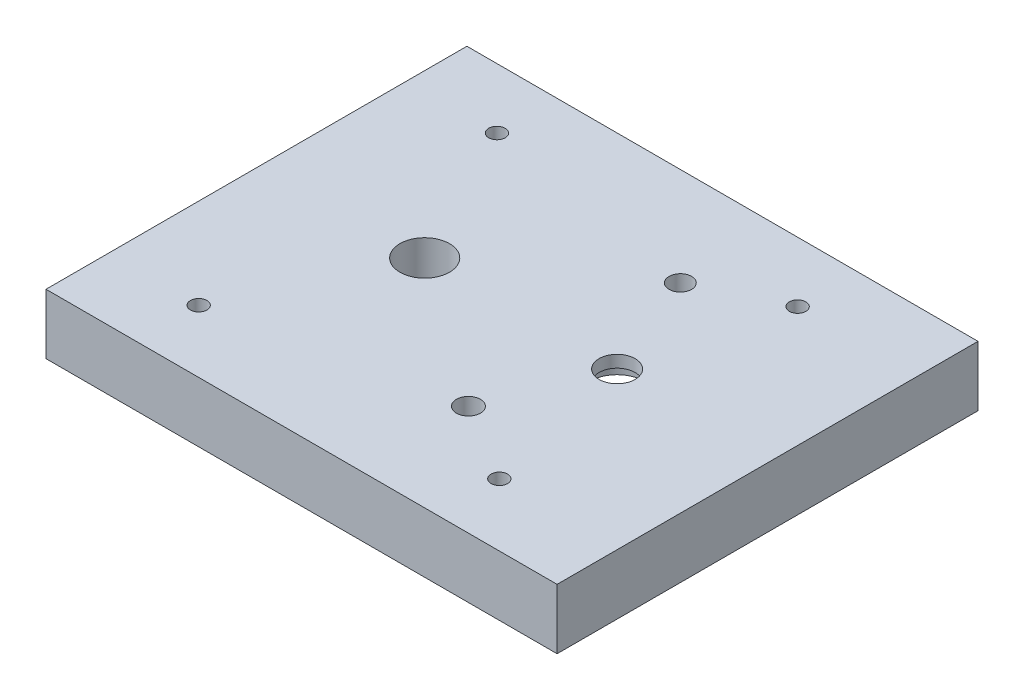
ISO-10303-21;
HEADER;
FILE_DESCRIPTION(('STEP AP214'),'2;1');
FILE_NAME('part.step','',(''),(''),'','','');
FILE_SCHEMA(('AUTOMOTIVE_DESIGN { 1 0 10303 214 1 1 1 1 }'));
ENDSEC;
DATA;
#1=APPLICATION_CONTEXT('core data for automotive mechanical design processes');
#2=APPLICATION_PROTOCOL_DEFINITION('international standard','automotive_design',2000,#1);
#3=PRODUCT_CONTEXT('',#1,'mechanical');
#4=PRODUCT('Part','Part','',(#3));
#5=PRODUCT_RELATED_PRODUCT_CATEGORY('part','',(#4));
#6=PRODUCT_DEFINITION_FORMATION('','',#4);
#7=PRODUCT_DEFINITION_CONTEXT('part definition',#1,'design');
#8=PRODUCT_DEFINITION('design','',#6,#7);
#9=PRODUCT_DEFINITION_SHAPE('','',#8);
#10=(LENGTH_UNIT() NAMED_UNIT(*) SI_UNIT(.MILLI.,.METRE.));
#11=(NAMED_UNIT(*) PLANE_ANGLE_UNIT() SI_UNIT($,.RADIAN.));
#12=(NAMED_UNIT(*) SI_UNIT($,.STERADIAN.) SOLID_ANGLE_UNIT());
#13=UNCERTAINTY_MEASURE_WITH_UNIT(LENGTH_MEASURE(1.E-05),#10,'distance_accuracy_value','');
#14=(GEOMETRIC_REPRESENTATION_CONTEXT(3) GLOBAL_UNCERTAINTY_ASSIGNED_CONTEXT((#13)) GLOBAL_UNIT_ASSIGNED_CONTEXT((#10,
#11,#12)) REPRESENTATION_CONTEXT('',''));
#15=CARTESIAN_POINT('',(0.,0.,0.));
#16=DIRECTION('',(0.,0.,1.));
#17=DIRECTION('',(1.,0.,0.));
#18=AXIS2_PLACEMENT_3D('',#15,#16,#17);
#19=CARTESIAN_POINT('',(42.5,10.,0.));
#20=DIRECTION('',(1.,0.,0.));
#21=DIRECTION('',(0.,0.,-1.));
#22=AXIS2_PLACEMENT_3D('',#19,#20,#21);
#23=PLANE('',#22);
#24=DIRECTION('',(0.,0.,1.));
#25=VECTOR('',#24,1.);
#26=CARTESIAN_POINT('',(42.5,0.,0.));
#27=LINE('',#26,#25);
#28=CARTESIAN_POINT('',(42.5,0.,-35.));
#29=VERTEX_POINT('',#28);
#30=CARTESIAN_POINT('',(42.5,0.,35.));
#31=VERTEX_POINT('',#30);
#32=EDGE_CURVE('E231',#29,#31,#27,.T.);
#33=ORIENTED_EDGE('',*,*,#32,.F.);
#34=DIRECTION('',(0.,-1.,0.));
#35=VECTOR('',#34,1.);
#36=CARTESIAN_POINT('',(42.5,10.,-35.));
#37=LINE('',#36,#35);
#38=CARTESIAN_POINT('',(42.5,10.,-35.));
#39=VERTEX_POINT('',#38);
#40=EDGE_CURVE('E11',#39,#29,#37,.T.);
#41=ORIENTED_EDGE('',*,*,#40,.F.);
#42=DIRECTION('',(0.,0.,1.));
#43=VECTOR('',#42,1.);
#44=CARTESIAN_POINT('',(42.5,10.,0.));
#45=LINE('',#44,#43);
#46=CARTESIAN_POINT('',(42.5,10.,35.));
#47=VERTEX_POINT('',#46);
#48=EDGE_CURVE('E270',#39,#47,#45,.T.);
#49=ORIENTED_EDGE('',*,*,#48,.T.);
#50=DIRECTION('',(0.,-1.,0.));
#51=VECTOR('',#50,1.);
#52=CARTESIAN_POINT('',(42.5,10.,35.));
#53=LINE('',#52,#51);
#54=EDGE_CURVE('E90',#47,#31,#53,.T.);
#55=ORIENTED_EDGE('',*,*,#54,.T.);
#56=EDGE_LOOP('',(#33,#41,#49,#55));
#57=FACE_BOUND('',#56,.T.);
#58=ADVANCED_FACE('F38',(#57),#23,.T.);
#59=CARTESIAN_POINT('',(0.,10.,-35.));
#60=DIRECTION('',(0.,0.,-1.));
#61=DIRECTION('',(-1.,0.,0.));
#62=AXIS2_PLACEMENT_3D('',#59,#60,#61);
#63=PLANE('',#62);
#64=DIRECTION('',(1.,0.,0.));
#65=VECTOR('',#64,1.);
#66=CARTESIAN_POINT('',(0.,0.,-35.));
#67=LINE('',#66,#65);
#68=CARTESIAN_POINT('',(-42.5,0.,-35.));
#69=VERTEX_POINT('',#68);
#70=EDGE_CURVE('E228',#69,#29,#67,.T.);
#71=ORIENTED_EDGE('',*,*,#70,.F.);
#72=DIRECTION('',(0.,-1.,0.));
#73=VECTOR('',#72,1.);
#74=CARTESIAN_POINT('',(-42.5,10.,-35.));
#75=LINE('',#74,#73);
#76=CARTESIAN_POINT('',(-42.5,10.,-35.));
#77=VERTEX_POINT('',#76);
#78=EDGE_CURVE('E47',#77,#69,#75,.T.);
#79=ORIENTED_EDGE('',*,*,#78,.F.);
#80=DIRECTION('',(1.,0.,0.));
#81=VECTOR('',#80,1.);
#82=CARTESIAN_POINT('',(0.,10.,-35.));
#83=LINE('',#82,#81);
#84=EDGE_CURVE('E267',#77,#39,#83,.T.);
#85=ORIENTED_EDGE('',*,*,#84,.T.);
#86=ORIENTED_EDGE('',*,*,#40,.T.);
#87=EDGE_LOOP('',(#71,#79,#85,#86));
#88=FACE_BOUND('',#87,.T.);
#89=ADVANCED_FACE('F453',(#88),#63,.T.);
#90=CARTESIAN_POINT('',(-42.5,10.,0.));
#91=DIRECTION('',(1.,0.,0.));
#92=DIRECTION('',(0.,0.,-1.));
#93=AXIS2_PLACEMENT_3D('',#90,#91,#92);
#94=PLANE('',#93);
#95=DIRECTION('',(0.,0.,1.));
#96=VECTOR('',#95,1.);
#97=CARTESIAN_POINT('',(-42.5,0.,0.));
#98=LINE('',#97,#96);
#99=CARTESIAN_POINT('',(-42.5,0.,35.));
#100=VERTEX_POINT('',#99);
#101=EDGE_CURVE('E225',#69,#100,#98,.T.);
#102=ORIENTED_EDGE('',*,*,#101,.T.);
#103=DIRECTION('',(0.,-1.,0.));
#104=VECTOR('',#103,1.);
#105=CARTESIAN_POINT('',(-42.5,10.,35.));
#106=LINE('',#105,#104);
#107=CARTESIAN_POINT('',(-42.5,10.,35.));
#108=VERTEX_POINT('',#107);
#109=EDGE_CURVE('E208',#108,#100,#106,.T.);
#110=ORIENTED_EDGE('',*,*,#109,.F.);
#111=DIRECTION('',(0.,0.,1.));
#112=VECTOR('',#111,1.);
#113=CARTESIAN_POINT('',(-42.5,10.,0.));
#114=LINE('',#113,#112);
#115=EDGE_CURVE('E265',#77,#108,#114,.T.);
#116=ORIENTED_EDGE('',*,*,#115,.F.);
#117=ORIENTED_EDGE('',*,*,#78,.T.);
#118=EDGE_LOOP('',(#102,#110,#116,#117));
#119=FACE_BOUND('',#118,.T.);
#120=ADVANCED_FACE('F458',(#119),#94,.F.);
#121=CARTESIAN_POINT('',(0.,10.,2.15490997050941));
#122=DIRECTION('',(0.,0.,-1.));
#123=DIRECTION('',(-1.,0.,0.));
#124=AXIS2_PLACEMENT_3D('',#121,#122,#123);
#125=PLANE('',#124);
#126=DIRECTION('',(1.,0.,0.));
#127=VECTOR('',#126,1.);
#128=CARTESIAN_POINT('',(-9.73184743646242,6.,2.15490997050941));
#129=LINE('',#128,#127);
#130=CARTESIAN_POINT('',(-9.73184743646242,6.,2.15490997050941));
#131=VERTEX_POINT('',#130);
#132=CARTESIAN_POINT('',(-7.49999999999999,6.,2.15490997050941));
#133=VERTEX_POINT('',#132);
#134=EDGE_CURVE('E182',#131,#133,#129,.T.);
#135=ORIENTED_EDGE('',*,*,#134,.T.);
#136=DIRECTION('',(0.,-1.,0.));
#137=VECTOR('',#136,1.);
#138=CARTESIAN_POINT('',(-7.49999999999999,6.,2.15490997050941));
#139=LINE('',#138,#137);
#140=CARTESIAN_POINT('',(-7.49999999999999,0.,2.15490997050941));
#141=VERTEX_POINT('',#140);
#142=EDGE_CURVE('E285',#133,#141,#139,.T.);
#143=ORIENTED_EDGE('',*,*,#142,.T.);
#144=DIRECTION('',(1.,0.,0.));
#145=VECTOR('',#144,1.);
#146=CARTESIAN_POINT('',(0.,0.,2.15490997050941));
#147=LINE('',#146,#145);
#148=CARTESIAN_POINT('',(-9.73184743646242,0.,2.15490997050941));
#149=VERTEX_POINT('',#148);
#150=EDGE_CURVE('E207',#149,#141,#147,.T.);
#151=ORIENTED_EDGE('',*,*,#150,.F.);
#152=DIRECTION('',(0.,-1.,0.));
#153=VECTOR('',#152,1.);
#154=CARTESIAN_POINT('',(-9.73184743646242,10.,2.15490997050941));
#155=LINE('',#154,#153);
#156=EDGE_CURVE('E201',#131,#149,#155,.T.);
#157=ORIENTED_EDGE('',*,*,#156,.F.);
#158=EDGE_LOOP('',(#135,#143,#151,#157));
#159=FACE_BOUND('',#158,.T.);
#160=ADVANCED_FACE('F40',(#159),#125,.T.);
#161=CARTESIAN_POINT('',(-9.73184743646242,10.,0.));
#162=DIRECTION('',(-1.,0.,0.));
#163=DIRECTION('',(0.,0.,1.));
#164=AXIS2_PLACEMENT_3D('',#161,#162,#163);
#165=PLANE('',#164);
#166=DIRECTION('',(0.,-1.,0.));
#167=VECTOR('',#166,1.);
#168=CARTESIAN_POINT('',(-9.73184743646242,10.,-4.15490997050938));
#169=LINE('',#168,#167);
#170=CARTESIAN_POINT('',(-9.73184743646242,6.,-4.15490997050938));
#171=VERTEX_POINT('',#170);
#172=CARTESIAN_POINT('',(-9.73184743646242,0.,-4.15490997050938));
#173=VERTEX_POINT('',#172);
#174=EDGE_CURVE('E203',#171,#173,#169,.T.);
#175=ORIENTED_EDGE('',*,*,#174,.F.);
#176=DIRECTION('',(0.,0.,1.));
#177=VECTOR('',#176,1.);
#178=CARTESIAN_POINT('',(-9.73184743646242,6.,2.15490997050941));
#179=LINE('',#178,#177);
#180=EDGE_CURVE('E186',#171,#131,#179,.T.);
#181=ORIENTED_EDGE('',*,*,#180,.T.);
#182=ORIENTED_EDGE('',*,*,#156,.T.);
#183=DIRECTION('',(0.,0.,-1.));
#184=VECTOR('',#183,1.);
#185=CARTESIAN_POINT('',(-9.73184743646242,0.,0.));
#186=LINE('',#185,#184);
#187=EDGE_CURVE('E246',#149,#173,#186,.T.);
#188=ORIENTED_EDGE('',*,*,#187,.T.);
#189=EDGE_LOOP('',(#175,#181,#182,#188));
#190=FACE_BOUND('',#189,.T.);
#191=ADVANCED_FACE('F199',(#190),#165,.F.);
#192=CARTESIAN_POINT('',(-15.52,10.,-0.999999999999982));
#193=DIRECTION('',(0.,-1.,0.));
#194=DIRECTION('',(0.,0.,-1.));
#195=AXIS2_PLACEMENT_3D('',#192,#193,#194);
#196=CYLINDRICAL_SURFACE('',#195,4.125);
#197=CARTESIAN_POINT('',(-15.52,10.,-0.999999999999982));
#198=DIRECTION('',(0.,1.,0.));
#199=DIRECTION('',(0.,0.,1.));
#200=AXIS2_PLACEMENT_3D('',#197,#198,#199);
#201=CIRCLE('',#200,4.125);
#202=CARTESIAN_POINT('',(-15.52,10.,3.12500000000002));
#203=VERTEX_POINT('',#202);
#204=EDGE_CURVE('E252',#203,#203,#201,.T.);
#205=ORIENTED_EDGE('',*,*,#204,.T.);
#206=EDGE_LOOP('',(#205));
#207=FACE_BOUND('',#206,.T.);
#208=CARTESIAN_POINT('',(-15.52,0.,-0.999999999999982));
#209=DIRECTION('',(0.,1.,0.));
#210=DIRECTION('',(0.,0.,1.));
#211=AXIS2_PLACEMENT_3D('',#208,#209,#210);
#212=CIRCLE('',#211,4.125);
#213=CARTESIAN_POINT('',(-15.52,0.,3.12500000000002));
#214=VERTEX_POINT('',#213);
#215=EDGE_CURVE('E216',#214,#214,#212,.T.);
#216=ORIENTED_EDGE('',*,*,#215,.F.);
#217=EDGE_LOOP('',(#216));
#218=FACE_BOUND('',#217,.T.);
#219=ADVANCED_FACE('F479',(#207,#218),#196,.F.);
#220=CARTESIAN_POINT('',(9.47498964468786,10.,16.7226001518999));
#221=DIRECTION('',(0.,-1.,0.));
#222=DIRECTION('',(0.,0.,-1.));
#223=AXIS2_PLACEMENT_3D('',#220,#221,#222);
#224=CYLINDRICAL_SURFACE('',#223,2.);
#225=CARTESIAN_POINT('',(9.47498964468786,6.,16.7226001518999));
#226=DIRECTION('',(0.,1.,0.));
#227=DIRECTION('',(0.,0.,1.));
#228=AXIS2_PLACEMENT_3D('',#225,#226,#227);
#229=CIRCLE('',#228,2.);
#230=CARTESIAN_POINT('',(9.47498964468786,6.,18.7226001518999));
#231=VERTEX_POINT('',#230);
#232=EDGE_CURVE('E371',#231,#231,#229,.T.);
#233=ORIENTED_EDGE('',*,*,#232,.F.);
#234=EDGE_LOOP('',(#233));
#235=FACE_BOUND('',#234,.T.);
#236=CARTESIAN_POINT('',(9.47498964468786,10.,16.7226001518999));
#237=DIRECTION('',(0.,1.,0.));
#238=DIRECTION('',(0.,0.,1.));
#239=AXIS2_PLACEMENT_3D('',#236,#237,#238);
#240=CIRCLE('',#239,2.);
#241=CARTESIAN_POINT('',(9.47498964468786,10.,18.7226001518999));
#242=VERTEX_POINT('',#241);
#243=EDGE_CURVE('E255',#242,#242,#240,.T.);
#244=ORIENTED_EDGE('',*,*,#243,.T.);
#245=EDGE_LOOP('',(#244));
#246=FACE_BOUND('',#245,.T.);
#247=ADVANCED_FACE('F484',(#235,#246),#224,.F.);
#248=CARTESIAN_POINT('',(9.33088549516382,10.,-18.6646873960116));
#249=DIRECTION('',(0.,-1.,0.));
#250=DIRECTION('',(0.,0.,-1.));
#251=AXIS2_PLACEMENT_3D('',#248,#249,#250);
#252=CYLINDRICAL_SURFACE('',#251,1.875);
#253=CARTESIAN_POINT('',(9.33088549516382,6.,-18.6646873960116));
#254=DIRECTION('',(0.,1.,0.));
#255=DIRECTION('',(0.,0.,1.));
#256=AXIS2_PLACEMENT_3D('',#253,#254,#255);
#257=CIRCLE('',#256,1.875);
#258=CARTESIAN_POINT('',(9.33088549516382,6.,-16.7896873960116));
#259=VERTEX_POINT('',#258);
#260=EDGE_CURVE('E311',#259,#259,#257,.T.);
#261=ORIENTED_EDGE('',*,*,#260,.F.);
#262=EDGE_LOOP('',(#261));
#263=FACE_BOUND('',#262,.T.);
#264=CARTESIAN_POINT('',(9.33088549516382,10.,-18.6646873960116));
#265=DIRECTION('',(0.,1.,0.));
#266=DIRECTION('',(0.,0.,1.));
#267=AXIS2_PLACEMENT_3D('',#264,#265,#266);
#268=CIRCLE('',#267,1.875);
#269=CARTESIAN_POINT('',(9.33088549516382,10.,-16.7896873960116));
#270=VERTEX_POINT('',#269);
#271=EDGE_CURVE('E258',#270,#270,#268,.T.);
#272=ORIENTED_EDGE('',*,*,#271,.T.);
#273=EDGE_LOOP('',(#272));
#274=FACE_BOUND('',#273,.T.);
#275=ADVANCED_FACE('F500',(#263,#274),#252,.F.);
#276=CARTESIAN_POINT('',(-27.5,10.,24.6066772895717));
#277=DIRECTION('',(0.,-1.,0.));
#278=DIRECTION('',(0.,0.,-1.));
#279=AXIS2_PLACEMENT_3D('',#276,#277,#278);
#280=CYLINDRICAL_SURFACE('',#279,1.375);
#281=CARTESIAN_POINT('',(-27.5,10.,24.6066772895717));
#282=DIRECTION('',(0.,1.,0.));
#283=DIRECTION('',(0.,0.,1.));
#284=AXIS2_PLACEMENT_3D('',#281,#282,#283);
#285=CIRCLE('',#284,1.375);
#286=CARTESIAN_POINT('',(-27.5,10.,25.9816772895717));
#287=VERTEX_POINT('',#286);
#288=EDGE_CURVE('E261',#287,#287,#285,.F.);
#289=ORIENTED_EDGE('',*,*,#288,.F.);
#290=EDGE_LOOP('',(#289));
#291=FACE_BOUND('',#290,.T.);
#292=CARTESIAN_POINT('',(-27.5,0.,24.6066772895717));
#293=DIRECTION('',(0.,1.,0.));
#294=DIRECTION('',(0.,0.,1.));
#295=AXIS2_PLACEMENT_3D('',#292,#293,#294);
#296=CIRCLE('',#295,1.375);
#297=CARTESIAN_POINT('',(-27.5,0.,25.9816772895717));
#298=VERTEX_POINT('',#297);
#299=EDGE_CURVE('E220',#298,#298,#296,.F.);
#300=ORIENTED_EDGE('',*,*,#299,.T.);
#301=EDGE_LOOP('',(#300));
#302=FACE_BOUND('',#301,.T.);
#303=ADVANCED_FACE('F496',(#291,#302),#280,.F.);
#304=CARTESIAN_POINT('',(0.,10.,35.));
#305=DIRECTION('',(0.,0.,-1.));
#306=DIRECTION('',(-1.,0.,0.));
#307=AXIS2_PLACEMENT_3D('',#304,#305,#306);
#308=PLANE('',#307);
#309=DIRECTION('',(1.,0.,0.));
#310=VECTOR('',#309,1.);
#311=CARTESIAN_POINT('',(0.,0.,35.));
#312=LINE('',#311,#310);
#313=EDGE_CURVE('E223',#100,#31,#312,.T.);
#314=ORIENTED_EDGE('',*,*,#313,.T.);
#315=ORIENTED_EDGE('',*,*,#54,.F.);
#316=DIRECTION('',(1.,0.,0.));
#317=VECTOR('',#316,1.);
#318=CARTESIAN_POINT('',(0.,10.,35.));
#319=LINE('',#318,#317);
#320=EDGE_CURVE('E64',#108,#47,#319,.T.);
#321=ORIENTED_EDGE('',*,*,#320,.F.);
#322=ORIENTED_EDGE('',*,*,#109,.T.);
#323=EDGE_LOOP('',(#314,#315,#321,#322));
#324=FACE_BOUND('',#323,.T.);
#325=ADVANCED_FACE('F467',(#324),#308,.F.);
#326=CARTESIAN_POINT('',(-27.5,10.,-25.));
#327=DIRECTION('',(0.,-1.,0.));
#328=DIRECTION('',(0.,0.,-1.));
#329=AXIS2_PLACEMENT_3D('',#326,#327,#328);
#330=CYLINDRICAL_SURFACE('',#329,1.375);
#331=CARTESIAN_POINT('',(-27.5,10.,-25.));
#332=DIRECTION('',(0.,1.,0.));
#333=DIRECTION('',(0.,0.,1.));
#334=AXIS2_PLACEMENT_3D('',#331,#332,#333);
#335=CIRCLE('',#334,1.375);
#336=CARTESIAN_POINT('',(-27.5,10.,-23.625));
#337=VERTEX_POINT('',#336);
#338=EDGE_CURVE('E272',#337,#337,#335,.T.);
#339=ORIENTED_EDGE('',*,*,#338,.T.);
#340=EDGE_LOOP('',(#339));
#341=FACE_BOUND('',#340,.T.);
#342=CARTESIAN_POINT('',(-27.5,0.,-25.));
#343=DIRECTION('',(0.,1.,0.));
#344=DIRECTION('',(0.,0.,1.));
#345=AXIS2_PLACEMENT_3D('',#342,#343,#344);
#346=CIRCLE('',#345,1.375);
#347=CARTESIAN_POINT('',(-27.5,0.,-23.625));
#348=VERTEX_POINT('',#347);
#349=EDGE_CURVE('E234',#348,#348,#346,.T.);
#350=ORIENTED_EDGE('',*,*,#349,.F.);
#351=EDGE_LOOP('',(#350));
#352=FACE_BOUND('',#351,.T.);
#353=ADVANCED_FACE('F463',(#341,#352),#330,.F.);
#354=CARTESIAN_POINT('',(22.5,10.,-25.));
#355=DIRECTION('',(0.,-1.,0.));
#356=DIRECTION('',(0.,0.,-1.));
#357=AXIS2_PLACEMENT_3D('',#354,#355,#356);
#358=CYLINDRICAL_SURFACE('',#357,1.375);
#359=CARTESIAN_POINT('',(22.5,10.,-25.));
#360=DIRECTION('',(0.,1.,0.));
#361=DIRECTION('',(0.,0.,1.));
#362=AXIS2_PLACEMENT_3D('',#359,#360,#361);
#363=CIRCLE('',#362,1.375);
#364=CARTESIAN_POINT('',(22.5,10.,-23.625));
#365=VERTEX_POINT('',#364);
#366=EDGE_CURVE('E275',#365,#365,#363,.T.);
#367=ORIENTED_EDGE('',*,*,#366,.T.);
#368=EDGE_LOOP('',(#367));
#369=FACE_BOUND('',#368,.T.);
#370=CARTESIAN_POINT('',(22.5,0.,-25.));
#371=DIRECTION('',(0.,1.,0.));
#372=DIRECTION('',(0.,0.,1.));
#373=AXIS2_PLACEMENT_3D('',#370,#371,#372);
#374=CIRCLE('',#373,1.375);
#375=CARTESIAN_POINT('',(22.5,0.,-23.625));
#376=VERTEX_POINT('',#375);
#377=EDGE_CURVE('E237',#376,#376,#374,.T.);
#378=ORIENTED_EDGE('',*,*,#377,.F.);
#379=EDGE_LOOP('',(#378));
#380=FACE_BOUND('',#379,.T.);
#381=ADVANCED_FACE('F466',(#369,#380),#358,.F.);
#382=CARTESIAN_POINT('',(22.5,10.,24.6066772895717));
#383=DIRECTION('',(0.,-1.,0.));
#384=DIRECTION('',(0.,0.,-1.));
#385=AXIS2_PLACEMENT_3D('',#382,#383,#384);
#386=CYLINDRICAL_SURFACE('',#385,1.375);
#387=CARTESIAN_POINT('',(22.5,10.,24.6066772895717));
#388=DIRECTION('',(0.,1.,0.));
#389=DIRECTION('',(0.,0.,1.));
#390=AXIS2_PLACEMENT_3D('',#387,#388,#389);
#391=CIRCLE('',#390,1.375);
#392=CARTESIAN_POINT('',(22.5,10.,25.9816772895717));
#393=VERTEX_POINT('',#392);
#394=EDGE_CURVE('E219',#393,#393,#391,.F.);
#395=ORIENTED_EDGE('',*,*,#394,.F.);
#396=EDGE_LOOP('',(#395));
#397=FACE_BOUND('',#396,.T.);
#398=CARTESIAN_POINT('',(22.5,0.,24.6066772895717));
#399=DIRECTION('',(0.,1.,0.));
#400=DIRECTION('',(0.,0.,1.));
#401=AXIS2_PLACEMENT_3D('',#398,#399,#400);
#402=CIRCLE('',#401,1.375);
#403=CARTESIAN_POINT('',(22.5,0.,25.9816772895717));
#404=VERTEX_POINT('',#403);
#405=EDGE_CURVE('E240',#404,#404,#402,.F.);
#406=ORIENTED_EDGE('',*,*,#405,.T.);
#407=EDGE_LOOP('',(#406));
#408=FACE_BOUND('',#407,.T.);
#409=ADVANCED_FACE('F471',(#397,#408),#386,.F.);
#410=CARTESIAN_POINT('',(0.,10.,-4.15490997050937));
#411=DIRECTION('',(0.,0.,-1.));
#412=DIRECTION('',(-1.,0.,0.));
#413=AXIS2_PLACEMENT_3D('',#410,#411,#412);
#414=PLANE('',#413);
#415=DIRECTION('',(0.,-1.,0.));
#416=VECTOR('',#415,1.);
#417=CARTESIAN_POINT('',(-7.49999999999999,6.,-4.15490997050938));
#418=LINE('',#417,#416);
#419=CARTESIAN_POINT('',(-7.49999999999999,6.,-4.15490997050938));
#420=VERTEX_POINT('',#419);
#421=CARTESIAN_POINT('',(-7.49999999999999,0.,-4.15490997050938));
#422=VERTEX_POINT('',#421);
#423=EDGE_CURVE('E283',#420,#422,#418,.T.);
#424=ORIENTED_EDGE('',*,*,#423,.F.);
#425=DIRECTION('',(-1.,0.,0.));
#426=VECTOR('',#425,1.);
#427=CARTESIAN_POINT('',(-9.73184743646242,6.,-4.15490997050938));
#428=LINE('',#427,#426);
#429=EDGE_CURVE('E195',#420,#171,#428,.T.);
#430=ORIENTED_EDGE('',*,*,#429,.T.);
#431=ORIENTED_EDGE('',*,*,#174,.T.);
#432=DIRECTION('',(1.,0.,0.));
#433=VECTOR('',#432,1.);
#434=CARTESIAN_POINT('',(0.,0.,-4.15490997050937));
#435=LINE('',#434,#433);
#436=EDGE_CURVE('E243',#173,#422,#435,.T.);
#437=ORIENTED_EDGE('',*,*,#436,.T.);
#438=EDGE_LOOP('',(#424,#430,#431,#437));
#439=FACE_BOUND('',#438,.T.);
#440=ADVANCED_FACE('F384',(#439),#414,.F.);
#441=CARTESIAN_POINT('',(16.4783394877401,10.,-0.999882702112446));
#442=DIRECTION('',(0.,-1.,0.));
#443=DIRECTION('',(0.,0.,-1.));
#444=AXIS2_PLACEMENT_3D('',#441,#442,#443);
#445=CYLINDRICAL_SURFACE('',#444,2.99999999999999);
#446=CARTESIAN_POINT('',(16.4783394877401,8.,-0.999882702112446));
#447=DIRECTION('',(0.,1.,0.));
#448=DIRECTION('',(0.,0.,1.));
#449=AXIS2_PLACEMENT_3D('',#446,#447,#448);
#450=CIRCLE('',#449,2.99999999999999);
#451=CARTESIAN_POINT('',(16.4783394877401,8.,2.00011729788755));
#452=VERTEX_POINT('',#451);
#453=EDGE_CURVE('E379',#452,#452,#450,.T.);
#454=ORIENTED_EDGE('',*,*,#453,.F.);
#455=EDGE_LOOP('',(#454));
#456=FACE_BOUND('',#455,.T.);
#457=CARTESIAN_POINT('',(16.4783394877401,10.,-0.999882702112446));
#458=DIRECTION('',(0.,1.,0.));
#459=DIRECTION('',(0.,0.,1.));
#460=AXIS2_PLACEMENT_3D('',#457,#458,#459);
#461=CIRCLE('',#460,2.99999999999999);
#462=CARTESIAN_POINT('',(16.4783394877401,10.,2.00011729788755));
#463=VERTEX_POINT('',#462);
#464=EDGE_CURVE('E210',#463,#463,#461,.T.);
#465=ORIENTED_EDGE('',*,*,#464,.T.);
#466=EDGE_LOOP('',(#465));
#467=FACE_BOUND('',#466,.T.);
#468=ADVANCED_FACE('F477',(#456,#467),#445,.F.);
#469=CARTESIAN_POINT('',(0.,10.,0.));
#470=DIRECTION('',(0.,1.,0.));
#471=DIRECTION('',(0.,0.,1.));
#472=AXIS2_PLACEMENT_3D('',#469,#470,#471);
#473=PLANE('',#472);
#474=ORIENTED_EDGE('',*,*,#394,.T.);
#475=EDGE_LOOP('',(#474));
#476=FACE_BOUND('',#475,.T.);
#477=ORIENTED_EDGE('',*,*,#366,.F.);
#478=EDGE_LOOP('',(#477));
#479=FACE_BOUND('',#478,.T.);
#480=ORIENTED_EDGE('',*,*,#338,.F.);
#481=EDGE_LOOP('',(#480));
#482=FACE_BOUND('',#481,.T.);
#483=ORIENTED_EDGE('',*,*,#48,.F.);
#484=ORIENTED_EDGE('',*,*,#84,.F.);
#485=ORIENTED_EDGE('',*,*,#115,.T.);
#486=ORIENTED_EDGE('',*,*,#320,.T.);
#487=EDGE_LOOP('',(#483,#484,#485,#486));
#488=FACE_BOUND('',#487,.T.);
#489=ORIENTED_EDGE('',*,*,#288,.T.);
#490=EDGE_LOOP('',(#489));
#491=FACE_BOUND('',#490,.T.);
#492=ORIENTED_EDGE('',*,*,#271,.F.);
#493=EDGE_LOOP('',(#492));
#494=FACE_BOUND('',#493,.T.);
#495=ORIENTED_EDGE('',*,*,#243,.F.);
#496=EDGE_LOOP('',(#495));
#497=FACE_BOUND('',#496,.T.);
#498=ORIENTED_EDGE('',*,*,#204,.F.);
#499=EDGE_LOOP('',(#498));
#500=FACE_BOUND('',#499,.T.);
#501=ORIENTED_EDGE('',*,*,#464,.F.);
#502=EDGE_LOOP('',(#501));
#503=FACE_BOUND('',#502,.T.);
#504=ADVANCED_FACE('F510',(#476,#479,#482,#488,#491,#494,#497,#500,#503),#473,.T.);
#505=CARTESIAN_POINT('',(0.,0.,0.));
#506=DIRECTION('',(0.,1.,0.));
#507=DIRECTION('',(0.,0.,1.));
#508=AXIS2_PLACEMENT_3D('',#505,#506,#507);
#509=PLANE('',#508);
#510=DIRECTION('',(1.,0.,0.));
#511=VECTOR('',#510,1.);
#512=CARTESIAN_POINT('',(0.,0.,-7.99999999999999));
#513=LINE('',#512,#511);
#514=CARTESIAN_POINT('',(-7.49999999999999,0.,-7.99999999999999));
#515=VERTEX_POINT('',#514);
#516=CARTESIAN_POINT('',(-2.85475616918439,0.,-7.99999999999999));
#517=VERTEX_POINT('',#516);
#518=EDGE_CURVE('E340',#515,#517,#513,.T.);
#519=ORIENTED_EDGE('',*,*,#518,.F.);
#520=DIRECTION('',(0.,0.,-1.));
#521=VECTOR('',#520,1.);
#522=CARTESIAN_POINT('',(-7.49999999999999,0.,0.));
#523=LINE('',#522,#521);
#524=EDGE_CURVE('E337',#422,#515,#523,.T.);
#525=ORIENTED_EDGE('',*,*,#524,.F.);
#526=ORIENTED_EDGE('',*,*,#436,.F.);
#527=ORIENTED_EDGE('',*,*,#187,.F.);
#528=ORIENTED_EDGE('',*,*,#150,.T.);
#529=CARTESIAN_POINT('',(-7.49999999999999,0.,6.00000000000001));
#530=VERTEX_POINT('',#529);
#531=EDGE_CURVE('E336',#530,#141,#523,.T.);
#532=ORIENTED_EDGE('',*,*,#531,.F.);
#533=DIRECTION('',(1.,0.,0.));
#534=VECTOR('',#533,1.);
#535=CARTESIAN_POINT('',(0.,0.,6.00000000000001));
#536=LINE('',#535,#534);
#537=CARTESIAN_POINT('',(-2.85475616918439,0.,6.00000000000001));
#538=VERTEX_POINT('',#537);
#539=EDGE_CURVE('E333',#530,#538,#536,.T.);
#540=ORIENTED_EDGE('',*,*,#539,.T.);
#541=CARTESIAN_POINT('',(9.50000000000001,0.,-0.999999999999987));
#542=DIRECTION('',(0.,1.,0.));
#543=DIRECTION('',(0.,0.,1.));
#544=AXIS2_PLACEMENT_3D('',#541,#542,#543);
#545=CIRCLE('',#544,14.2);
#546=CARTESIAN_POINT('',(5.84998964468786,0.,12.7228795959928));
#547=VERTEX_POINT('',#546);
#548=EDGE_CURVE('E330',#538,#547,#545,.T.);
#549=ORIENTED_EDGE('',*,*,#548,.T.);
#550=DIRECTION('',(0.,0.,-1.));
#551=VECTOR('',#550,1.);
#552=CARTESIAN_POINT('',(5.84998964468786,0.,0.));
#553=LINE('',#552,#551);
#554=CARTESIAN_POINT('',(5.84998964468786,0.,16.7226001518999));
#555=VERTEX_POINT('',#554);
#556=EDGE_CURVE('E327',#555,#547,#553,.T.);
#557=ORIENTED_EDGE('',*,*,#556,.F.);
#558=CARTESIAN_POINT('',(9.47498964468786,0.,16.7226001518999));
#559=DIRECTION('',(0.,1.,0.));
#560=DIRECTION('',(0.,0.,1.));
#561=AXIS2_PLACEMENT_3D('',#558,#559,#560);
#562=CIRCLE('',#561,3.625);
#563=CARTESIAN_POINT('',(13.0999896446879,0.,16.7226001518999));
#564=VERTEX_POINT('',#563);
#565=EDGE_CURVE('E324',#555,#564,#562,.T.);
#566=ORIENTED_EDGE('',*,*,#565,.T.);
#567=DIRECTION('',(0.,0.,-1.));
#568=VECTOR('',#567,1.);
#569=CARTESIAN_POINT('',(13.0999896446879,0.,0.));
#570=LINE('',#569,#568);
#571=CARTESIAN_POINT('',(13.0999896446879,0.,12.7360865809058));
#572=VERTEX_POINT('',#571);
#573=EDGE_CURVE('E321',#564,#572,#570,.T.);
#574=ORIENTED_EDGE('',*,*,#573,.T.);
#575=CARTESIAN_POINT('',(9.50000000000001,0.,-0.999999999999987));
#576=DIRECTION('',(0.,1.,0.));
#577=DIRECTION('',(0.,0.,1.));
#578=AXIS2_PLACEMENT_3D('',#575,#576,#577);
#579=CIRCLE('',#578,14.2);
#580=CARTESIAN_POINT('',(12.9558854951638,0.,-14.7730481537064));
#581=VERTEX_POINT('',#580);
#582=EDGE_CURVE('E318',#572,#581,#579,.T.);
#583=ORIENTED_EDGE('',*,*,#582,.T.);
#584=DIRECTION('',(0.,0.,1.));
#585=VECTOR('',#584,1.);
#586=CARTESIAN_POINT('',(12.9558854951638,0.,0.));
#587=LINE('',#586,#585);
#588=CARTESIAN_POINT('',(12.9558854951638,0.,-18.6646873960117));
#589=VERTEX_POINT('',#588);
#590=EDGE_CURVE('E315',#589,#581,#587,.T.);
#591=ORIENTED_EDGE('',*,*,#590,.F.);
#592=CARTESIAN_POINT('',(9.33088549516382,0.,-18.6646873960116));
#593=DIRECTION('',(0.,1.,0.));
#594=DIRECTION('',(0.,0.,1.));
#595=AXIS2_PLACEMENT_3D('',#592,#593,#594);
#596=CIRCLE('',#595,3.625);
#597=CARTESIAN_POINT('',(5.70588549516382,0.,-18.6646873960116));
#598=VERTEX_POINT('',#597);
#599=EDGE_CURVE('E312',#589,#598,#596,.T.);
#600=ORIENTED_EDGE('',*,*,#599,.T.);
#601=DIRECTION('',(0.,0.,1.));
#602=VECTOR('',#601,1.);
#603=CARTESIAN_POINT('',(5.70588549516382,0.,0.));
#604=LINE('',#603,#602);
#605=CARTESIAN_POINT('',(5.70588549516382,0.,-14.6837383460877));
#606=VERTEX_POINT('',#605);
#607=EDGE_CURVE('E308',#598,#606,#604,.T.);
#608=ORIENTED_EDGE('',*,*,#607,.T.);
#609=CARTESIAN_POINT('',(9.50000000000001,0.,-0.999999999999987));
#610=DIRECTION('',(0.,1.,0.));
#611=DIRECTION('',(0.,0.,1.));
#612=AXIS2_PLACEMENT_3D('',#609,#610,#611);
#613=CIRCLE('',#612,14.2);
#614=EDGE_CURVE('E55',#606,#517,#613,.T.);
#615=ORIENTED_EDGE('',*,*,#614,.T.);
#616=EDGE_LOOP('',(#519,#525,#526,#527,#528,#532,#540,#549,#557,#566,#574,#583,#591,#600,#608,#615));
#617=FACE_BOUND('',#616,.T.);
#618=ORIENTED_EDGE('',*,*,#405,.F.);
#619=EDGE_LOOP('',(#618));
#620=FACE_BOUND('',#619,.T.);
#621=ORIENTED_EDGE('',*,*,#377,.T.);
#622=EDGE_LOOP('',(#621));
#623=FACE_BOUND('',#622,.T.);
#624=ORIENTED_EDGE('',*,*,#349,.T.);
#625=EDGE_LOOP('',(#624));
#626=FACE_BOUND('',#625,.T.);
#627=ORIENTED_EDGE('',*,*,#32,.T.);
#628=ORIENTED_EDGE('',*,*,#313,.F.);
#629=ORIENTED_EDGE('',*,*,#101,.F.);
#630=ORIENTED_EDGE('',*,*,#70,.T.);
#631=EDGE_LOOP('',(#627,#628,#629,#630));
#632=FACE_BOUND('',#631,.T.);
#633=ORIENTED_EDGE('',*,*,#299,.F.);
#634=EDGE_LOOP('',(#633));
#635=FACE_BOUND('',#634,.T.);
#636=ORIENTED_EDGE('',*,*,#215,.T.);
#637=EDGE_LOOP('',(#636));
#638=FACE_BOUND('',#637,.T.);
#639=ADVANCED_FACE('F403',(#617,#620,#623,#626,#632,#635,#638),#509,.F.);
#640=CARTESIAN_POINT('',(16.4783394877401,6.,-0.999882702112446));
#641=DIRECTION('',(0.,1.,0.));
#642=DIRECTION('',(0.,0.,1.));
#643=AXIS2_PLACEMENT_3D('',#640,#641,#642);
#644=PLANE('',#643);
#645=CARTESIAN_POINT('',(16.4783394877401,6.,-0.999882702112446));
#646=DIRECTION('',(0.,1.,0.));
#647=DIRECTION('',(0.,0.,1.));
#648=AXIS2_PLACEMENT_3D('',#645,#646,#647);
#649=CIRCLE('',#648,4.5);
#650=CARTESIAN_POINT('',(16.4783394877401,6.,3.50011729788756));
#651=VERTEX_POINT('',#650);
#652=EDGE_CURVE('E42',#651,#651,#649,.F.);
#653=ORIENTED_EDGE('',*,*,#652,.F.);
#654=EDGE_LOOP('',(#653));
#655=FACE_BOUND('',#654,.T.);
#656=DIRECTION('',(0.,0.,-1.));
#657=VECTOR('',#656,1.);
#658=CARTESIAN_POINT('',(-7.49999999999999,6.,0.));
#659=LINE('',#658,#657);
#660=CARTESIAN_POINT('',(-7.49999999999999,6.,6.00000000000001));
#661=VERTEX_POINT('',#660);
#662=EDGE_CURVE('E190',#661,#133,#659,.T.);
#663=ORIENTED_EDGE('',*,*,#662,.T.);
#664=ORIENTED_EDGE('',*,*,#134,.F.);
#665=ORIENTED_EDGE('',*,*,#180,.F.);
#666=ORIENTED_EDGE('',*,*,#429,.F.);
#667=CARTESIAN_POINT('',(-7.49999999999999,6.,-7.99999999999999));
#668=VERTEX_POINT('',#667);
#669=EDGE_CURVE('E363',#420,#668,#659,.T.);
#670=ORIENTED_EDGE('',*,*,#669,.T.);
#671=DIRECTION('',(1.,0.,0.));
#672=VECTOR('',#671,1.);
#673=CARTESIAN_POINT('',(0.,6.,-7.99999999999999));
#674=LINE('',#673,#672);
#675=CARTESIAN_POINT('',(-2.85475616918439,6.,-7.99999999999999));
#676=VERTEX_POINT('',#675);
#677=EDGE_CURVE('E366',#668,#676,#674,.T.);
#678=ORIENTED_EDGE('',*,*,#677,.T.);
#679=CARTESIAN_POINT('',(9.50000000000001,6.,-0.999999999999987));
#680=DIRECTION('',(0.,1.,0.));
#681=DIRECTION('',(0.,0.,1.));
#682=AXIS2_PLACEMENT_3D('',#679,#680,#681);
#683=CIRCLE('',#682,14.2);
#684=CARTESIAN_POINT('',(5.70588549516382,6.,-14.6837383460877));
#685=VERTEX_POINT('',#684);
#686=EDGE_CURVE('E369',#685,#676,#683,.T.);
#687=ORIENTED_EDGE('',*,*,#686,.F.);
#688=DIRECTION('',(0.,0.,1.));
#689=VECTOR('',#688,1.);
#690=CARTESIAN_POINT('',(5.70588549516382,6.,0.));
#691=LINE('',#690,#689);
#692=CARTESIAN_POINT('',(5.70588549516382,6.,-18.6646873960116));
#693=VERTEX_POINT('',#692);
#694=EDGE_CURVE('E307',#693,#685,#691,.T.);
#695=ORIENTED_EDGE('',*,*,#694,.F.);
#696=CARTESIAN_POINT('',(9.33088549516382,6.,-18.6646873960116));
#697=DIRECTION('',(0.,1.,0.));
#698=DIRECTION('',(0.,0.,1.));
#699=AXIS2_PLACEMENT_3D('',#696,#697,#698);
#700=CIRCLE('',#699,3.625);
#701=CARTESIAN_POINT('',(12.9558854951638,6.,-18.6646873960117));
#702=VERTEX_POINT('',#701);
#703=EDGE_CURVE('E345',#702,#693,#700,.T.);
#704=ORIENTED_EDGE('',*,*,#703,.F.);
#705=DIRECTION('',(0.,0.,1.));
#706=VECTOR('',#705,1.);
#707=CARTESIAN_POINT('',(12.9558854951638,6.,0.));
#708=LINE('',#707,#706);
#709=CARTESIAN_POINT('',(12.9558854951638,6.,-14.7730481537064));
#710=VERTEX_POINT('',#709);
#711=EDGE_CURVE('E347',#702,#710,#708,.T.);
#712=ORIENTED_EDGE('',*,*,#711,.T.);
#713=CARTESIAN_POINT('',(9.50000000000001,6.,-0.999999999999987));
#714=DIRECTION('',(0.,1.,0.));
#715=DIRECTION('',(0.,0.,1.));
#716=AXIS2_PLACEMENT_3D('',#713,#714,#715);
#717=CIRCLE('',#716,14.2);
#718=CARTESIAN_POINT('',(13.0999896446879,6.,12.7360865809058));
#719=VERTEX_POINT('',#718);
#720=EDGE_CURVE('E350',#719,#710,#717,.T.);
#721=ORIENTED_EDGE('',*,*,#720,.F.);
#722=DIRECTION('',(0.,0.,-1.));
#723=VECTOR('',#722,1.);
#724=CARTESIAN_POINT('',(13.0999896446879,6.,0.));
#725=LINE('',#724,#723);
#726=CARTESIAN_POINT('',(13.0999896446879,6.,16.7226001518999));
#727=VERTEX_POINT('',#726);
#728=EDGE_CURVE('E352',#727,#719,#725,.T.);
#729=ORIENTED_EDGE('',*,*,#728,.F.);
#730=CARTESIAN_POINT('',(9.47498964468786,6.,16.7226001518999));
#731=DIRECTION('',(0.,1.,0.));
#732=DIRECTION('',(0.,0.,1.));
#733=AXIS2_PLACEMENT_3D('',#730,#731,#732);
#734=CIRCLE('',#733,3.625);
#735=CARTESIAN_POINT('',(5.84998964468786,6.,16.7226001518999));
#736=VERTEX_POINT('',#735);
#737=EDGE_CURVE('E354',#736,#727,#734,.T.);
#738=ORIENTED_EDGE('',*,*,#737,.F.);
#739=DIRECTION('',(0.,0.,-1.));
#740=VECTOR('',#739,1.);
#741=CARTESIAN_POINT('',(5.84998964468786,6.,0.));
#742=LINE('',#741,#740);
#743=CARTESIAN_POINT('',(5.84998964468786,6.,12.7228795959928));
#744=VERTEX_POINT('',#743);
#745=EDGE_CURVE('E356',#736,#744,#742,.T.);
#746=ORIENTED_EDGE('',*,*,#745,.T.);
#747=CARTESIAN_POINT('',(9.50000000000001,6.,-0.999999999999987));
#748=DIRECTION('',(0.,1.,0.));
#749=DIRECTION('',(0.,0.,1.));
#750=AXIS2_PLACEMENT_3D('',#747,#748,#749);
#751=CIRCLE('',#750,14.2);
#752=CARTESIAN_POINT('',(-2.85475616918439,6.,6.00000000000001));
#753=VERTEX_POINT('',#752);
#754=EDGE_CURVE('E359',#753,#744,#751,.T.);
#755=ORIENTED_EDGE('',*,*,#754,.F.);
#756=DIRECTION('',(1.,0.,0.));
#757=VECTOR('',#756,1.);
#758=CARTESIAN_POINT('',(0.,6.,6.00000000000001));
#759=LINE('',#758,#757);
#760=EDGE_CURVE('E361',#661,#753,#759,.T.);
#761=ORIENTED_EDGE('',*,*,#760,.F.);
#762=EDGE_LOOP('',(#663,#664,#665,#666,#670,#678,#687,#695,#704,#712,#721,#729,#738,#746,#755,#761));
#763=FACE_BOUND('',#762,.T.);
#764=ORIENTED_EDGE('',*,*,#260,.T.);
#765=EDGE_LOOP('',(#764));
#766=FACE_BOUND('',#765,.T.);
#767=ORIENTED_EDGE('',*,*,#232,.T.);
#768=EDGE_LOOP('',(#767));
#769=FACE_BOUND('',#768,.T.);
#770=ADVANCED_FACE('F184',(#655,#763,#766,#769),#644,.F.);
#771=CARTESIAN_POINT('',(9.50000000000001,6.,-0.999999999999987));
#772=DIRECTION('',(0.,-1.,0.));
#773=DIRECTION('',(0.,0.,-1.));
#774=AXIS2_PLACEMENT_3D('',#771,#772,#773);
#775=CYLINDRICAL_SURFACE('',#774,14.2);
#776=ORIENTED_EDGE('',*,*,#614,.F.);
#777=DIRECTION('',(0.,-1.,0.));
#778=VECTOR('',#777,1.);
#779=CARTESIAN_POINT('',(5.70588549516382,6.,-14.6837383460877));
#780=LINE('',#779,#778);
#781=EDGE_CURVE('E305',#685,#606,#780,.T.);
#782=ORIENTED_EDGE('',*,*,#781,.F.);
#783=ORIENTED_EDGE('',*,*,#686,.T.);
#784=DIRECTION('',(0.,-1.,0.));
#785=VECTOR('',#784,1.);
#786=CARTESIAN_POINT('',(-2.85475616918439,6.,-7.99999999999999));
#787=LINE('',#786,#785);
#788=EDGE_CURVE('E249',#676,#517,#787,.T.);
#789=ORIENTED_EDGE('',*,*,#788,.T.);
#790=EDGE_LOOP('',(#776,#782,#783,#789));
#791=FACE_BOUND('',#790,.T.);
#792=ADVANCED_FACE('F397',(#791),#775,.F.);
#793=CARTESIAN_POINT('',(0.,6.,-7.99999999999999));
#794=DIRECTION('',(0.,0.,-1.));
#795=DIRECTION('',(-1.,0.,0.));
#796=AXIS2_PLACEMENT_3D('',#793,#794,#795);
#797=PLANE('',#796);
#798=ORIENTED_EDGE('',*,*,#518,.T.);
#799=ORIENTED_EDGE('',*,*,#788,.F.);
#800=ORIENTED_EDGE('',*,*,#677,.F.);
#801=DIRECTION('',(0.,-1.,0.));
#802=VECTOR('',#801,1.);
#803=CARTESIAN_POINT('',(-7.49999999999999,6.,-7.99999999999999));
#804=LINE('',#803,#802);
#805=EDGE_CURVE('E281',#668,#515,#804,.T.);
#806=ORIENTED_EDGE('',*,*,#805,.T.);
#807=EDGE_LOOP('',(#798,#799,#800,#806));
#808=FACE_BOUND('',#807,.T.);
#809=ADVANCED_FACE('F393',(#808),#797,.F.);
#810=CARTESIAN_POINT('',(-7.49999999999999,6.,0.));
#811=DIRECTION('',(-1.,0.,0.));
#812=DIRECTION('',(0.,0.,1.));
#813=AXIS2_PLACEMENT_3D('',#810,#811,#812);
#814=PLANE('',#813);
#815=ORIENTED_EDGE('',*,*,#524,.T.);
#816=ORIENTED_EDGE('',*,*,#805,.F.);
#817=ORIENTED_EDGE('',*,*,#669,.F.);
#818=ORIENTED_EDGE('',*,*,#423,.T.);
#819=EDGE_LOOP('',(#815,#816,#817,#818));
#820=FACE_BOUND('',#819,.T.);
#821=ADVANCED_FACE('F387',(#820),#814,.F.);
#822=ORIENTED_EDGE('',*,*,#531,.T.);
#823=ORIENTED_EDGE('',*,*,#142,.F.);
#824=ORIENTED_EDGE('',*,*,#662,.F.);
#825=DIRECTION('',(0.,-1.,0.));
#826=VECTOR('',#825,1.);
#827=CARTESIAN_POINT('',(-7.49999999999999,6.,6.00000000000001));
#828=LINE('',#827,#826);
#829=EDGE_CURVE('E287',#661,#530,#828,.T.);
#830=ORIENTED_EDGE('',*,*,#829,.T.);
#831=EDGE_LOOP('',(#822,#823,#824,#830));
#832=FACE_BOUND('',#831,.T.);
#833=ADVANCED_FACE('F442',(#832),#814,.F.);
#834=CARTESIAN_POINT('',(0.,6.,6.00000000000001));
#835=DIRECTION('',(0.,0.,-1.));
#836=DIRECTION('',(-1.,0.,0.));
#837=AXIS2_PLACEMENT_3D('',#834,#835,#836);
#838=PLANE('',#837);
#839=ORIENTED_EDGE('',*,*,#539,.F.);
#840=ORIENTED_EDGE('',*,*,#829,.F.);
#841=ORIENTED_EDGE('',*,*,#760,.T.);
#842=DIRECTION('',(0.,-1.,0.));
#843=VECTOR('',#842,1.);
#844=CARTESIAN_POINT('',(-2.85475616918439,6.,6.00000000000001));
#845=LINE('',#844,#843);
#846=EDGE_CURVE('E289',#753,#538,#845,.T.);
#847=ORIENTED_EDGE('',*,*,#846,.T.);
#848=EDGE_LOOP('',(#839,#840,#841,#847));
#849=FACE_BOUND('',#848,.T.);
#850=ADVANCED_FACE('F439',(#849),#838,.T.);
#851=CARTESIAN_POINT('',(9.50000000000001,6.,-0.999999999999987));
#852=DIRECTION('',(0.,-1.,0.));
#853=DIRECTION('',(0.,0.,-1.));
#854=AXIS2_PLACEMENT_3D('',#851,#852,#853);
#855=CYLINDRICAL_SURFACE('',#854,14.2);
#856=ORIENTED_EDGE('',*,*,#548,.F.);
#857=ORIENTED_EDGE('',*,*,#846,.F.);
#858=ORIENTED_EDGE('',*,*,#754,.T.);
#859=DIRECTION('',(0.,-1.,0.));
#860=VECTOR('',#859,1.);
#861=CARTESIAN_POINT('',(5.84998964468786,6.,12.7228795959928));
#862=LINE('',#861,#860);
#863=EDGE_CURVE('E291',#744,#547,#862,.T.);
#864=ORIENTED_EDGE('',*,*,#863,.T.);
#865=EDGE_LOOP('',(#856,#857,#858,#864));
#866=FACE_BOUND('',#865,.T.);
#867=ADVANCED_FACE('F436',(#866),#855,.F.);
#868=CARTESIAN_POINT('',(5.84998964468786,6.,0.));
#869=DIRECTION('',(-1.,0.,0.));
#870=DIRECTION('',(0.,0.,1.));
#871=AXIS2_PLACEMENT_3D('',#868,#869,#870);
#872=PLANE('',#871);
#873=ORIENTED_EDGE('',*,*,#556,.T.);
#874=ORIENTED_EDGE('',*,*,#863,.F.);
#875=ORIENTED_EDGE('',*,*,#745,.F.);
#876=DIRECTION('',(0.,-1.,0.));
#877=VECTOR('',#876,1.);
#878=CARTESIAN_POINT('',(5.84998964468786,6.,16.7226001518999));
#879=LINE('',#878,#877);
#880=EDGE_CURVE('E293',#736,#555,#879,.T.);
#881=ORIENTED_EDGE('',*,*,#880,.T.);
#882=EDGE_LOOP('',(#873,#874,#875,#881));
#883=FACE_BOUND('',#882,.T.);
#884=ADVANCED_FACE('F430',(#883),#872,.F.);
#885=CARTESIAN_POINT('',(9.47498964468786,6.,16.7226001518999));
#886=DIRECTION('',(0.,-1.,0.));
#887=DIRECTION('',(0.,0.,-1.));
#888=AXIS2_PLACEMENT_3D('',#885,#886,#887);
#889=CYLINDRICAL_SURFACE('',#888,3.625);
#890=ORIENTED_EDGE('',*,*,#565,.F.);
#891=ORIENTED_EDGE('',*,*,#880,.F.);
#892=ORIENTED_EDGE('',*,*,#737,.T.);
#893=DIRECTION('',(0.,-1.,0.));
#894=VECTOR('',#893,1.);
#895=CARTESIAN_POINT('',(13.0999896446879,6.,16.7226001518999));
#896=LINE('',#895,#894);
#897=EDGE_CURVE('E295',#727,#564,#896,.T.);
#898=ORIENTED_EDGE('',*,*,#897,.T.);
#899=EDGE_LOOP('',(#890,#891,#892,#898));
#900=FACE_BOUND('',#899,.T.);
#901=ADVANCED_FACE('F427',(#900),#889,.F.);
#902=CARTESIAN_POINT('',(13.0999896446879,6.,0.));
#903=DIRECTION('',(-1.,0.,0.));
#904=DIRECTION('',(0.,0.,1.));
#905=AXIS2_PLACEMENT_3D('',#902,#903,#904);
#906=PLANE('',#905);
#907=ORIENTED_EDGE('',*,*,#573,.F.);
#908=ORIENTED_EDGE('',*,*,#897,.F.);
#909=ORIENTED_EDGE('',*,*,#728,.T.);
#910=DIRECTION('',(0.,-1.,0.));
#911=VECTOR('',#910,1.);
#912=CARTESIAN_POINT('',(13.0999896446879,6.,12.7360865809058));
#913=LINE('',#912,#911);
#914=EDGE_CURVE('E297',#719,#572,#913,.T.);
#915=ORIENTED_EDGE('',*,*,#914,.T.);
#916=EDGE_LOOP('',(#907,#908,#909,#915));
#917=FACE_BOUND('',#916,.T.);
#918=ADVANCED_FACE('F424',(#917),#906,.T.);
#919=CARTESIAN_POINT('',(9.50000000000001,6.,-0.999999999999987));
#920=DIRECTION('',(0.,-1.,0.));
#921=DIRECTION('',(0.,0.,-1.));
#922=AXIS2_PLACEMENT_3D('',#919,#920,#921);
#923=CYLINDRICAL_SURFACE('',#922,14.2);
#924=ORIENTED_EDGE('',*,*,#582,.F.);
#925=ORIENTED_EDGE('',*,*,#914,.F.);
#926=ORIENTED_EDGE('',*,*,#720,.T.);
#927=DIRECTION('',(0.,-1.,0.));
#928=VECTOR('',#927,1.);
#929=CARTESIAN_POINT('',(12.9558854951638,6.,-14.7730481537064));
#930=LINE('',#929,#928);
#931=EDGE_CURVE('E299',#710,#581,#930,.T.);
#932=ORIENTED_EDGE('',*,*,#931,.T.);
#933=EDGE_LOOP('',(#924,#925,#926,#932));
#934=FACE_BOUND('',#933,.T.);
#935=ADVANCED_FACE('F416',(#934),#923,.F.);
#936=CARTESIAN_POINT('',(12.9558854951638,6.,0.));
#937=DIRECTION('',(1.,0.,0.));
#938=DIRECTION('',(0.,0.,-1.));
#939=AXIS2_PLACEMENT_3D('',#936,#937,#938);
#940=PLANE('',#939);
#941=ORIENTED_EDGE('',*,*,#590,.T.);
#942=ORIENTED_EDGE('',*,*,#931,.F.);
#943=ORIENTED_EDGE('',*,*,#711,.F.);
#944=DIRECTION('',(0.,-1.,0.));
#945=VECTOR('',#944,1.);
#946=CARTESIAN_POINT('',(12.9558854951638,6.,-18.6646873960117));
#947=LINE('',#946,#945);
#948=EDGE_CURVE('E301',#702,#589,#947,.T.);
#949=ORIENTED_EDGE('',*,*,#948,.T.);
#950=EDGE_LOOP('',(#941,#942,#943,#949));
#951=FACE_BOUND('',#950,.T.);
#952=ADVANCED_FACE('F413',(#951),#940,.F.);
#953=CARTESIAN_POINT('',(9.33088549516382,6.,-18.6646873960116));
#954=DIRECTION('',(0.,-1.,0.));
#955=DIRECTION('',(0.,0.,-1.));
#956=AXIS2_PLACEMENT_3D('',#953,#954,#955);
#957=CYLINDRICAL_SURFACE('',#956,3.625);
#958=ORIENTED_EDGE('',*,*,#599,.F.);
#959=ORIENTED_EDGE('',*,*,#948,.F.);
#960=ORIENTED_EDGE('',*,*,#703,.T.);
#961=DIRECTION('',(0.,-1.,0.));
#962=VECTOR('',#961,1.);
#963=CARTESIAN_POINT('',(5.70588549516382,6.,-18.6646873960116));
#964=LINE('',#963,#962);
#965=EDGE_CURVE('E303',#693,#598,#964,.T.);
#966=ORIENTED_EDGE('',*,*,#965,.T.);
#967=EDGE_LOOP('',(#958,#959,#960,#966));
#968=FACE_BOUND('',#967,.T.);
#969=ADVANCED_FACE('F408',(#968),#957,.F.);
#970=CARTESIAN_POINT('',(5.70588549516382,6.,0.));
#971=DIRECTION('',(1.,0.,0.));
#972=DIRECTION('',(0.,0.,-1.));
#973=AXIS2_PLACEMENT_3D('',#970,#971,#972);
#974=PLANE('',#973);
#975=ORIENTED_EDGE('',*,*,#607,.F.);
#976=ORIENTED_EDGE('',*,*,#965,.F.);
#977=ORIENTED_EDGE('',*,*,#694,.T.);
#978=ORIENTED_EDGE('',*,*,#781,.T.);
#979=EDGE_LOOP('',(#975,#976,#977,#978));
#980=FACE_BOUND('',#979,.T.);
#981=ADVANCED_FACE('F400',(#980),#974,.T.);
#982=CARTESIAN_POINT('',(16.4783394877401,8.,-0.999882702112446));
#983=DIRECTION('',(0.,-1.,0.));
#984=DIRECTION('',(0.,0.,-1.));
#985=AXIS2_PLACEMENT_3D('',#982,#983,#984);
#986=CYLINDRICAL_SURFACE('',#985,4.5);
#987=CARTESIAN_POINT('',(16.4783394877401,8.,-0.999882702112446));
#988=DIRECTION('',(0.,1.,0.));
#989=DIRECTION('',(0.,0.,1.));
#990=AXIS2_PLACEMENT_3D('',#987,#988,#989);
#991=CIRCLE('',#990,4.5);
#992=CARTESIAN_POINT('',(16.4783394877401,8.,3.50011729788756));
#993=VERTEX_POINT('',#992);
#994=EDGE_CURVE('E376',#993,#993,#991,.T.);
#995=ORIENTED_EDGE('',*,*,#994,.T.);
#996=EDGE_LOOP('',(#995));
#997=FACE_BOUND('',#996,.T.);
#998=ORIENTED_EDGE('',*,*,#652,.T.);
#999=EDGE_LOOP('',(#998));
#1000=FACE_BOUND('',#999,.T.);
#1001=ADVANCED_FACE('F612',(#997,#1000),#986,.F.);
#1002=CARTESIAN_POINT('',(0.,8.,0.));
#1003=DIRECTION('',(0.,1.,0.));
#1004=DIRECTION('',(0.,0.,1.));
#1005=AXIS2_PLACEMENT_3D('',#1002,#1003,#1004);
#1006=PLANE('',#1005);
#1007=ORIENTED_EDGE('',*,*,#453,.T.);
#1008=EDGE_LOOP('',(#1007));
#1009=FACE_BOUND('',#1008,.T.);
#1010=ORIENTED_EDGE('',*,*,#994,.F.);
#1011=EDGE_LOOP('',(#1010));
#1012=FACE_BOUND('',#1011,.T.);
#1013=ADVANCED_FACE('F621',(#1009,#1012),#1006,.F.);
#1014=CLOSED_SHELL('',(#58,#89,#120,#160,#191,#219,#247,#275,#303,#325,#353,#381,#409,#440,#468,
#504,#639,#770,#792,#809,#821,#833,#850,#867,#884,#901,#918,#935,#952,#969,#981,#1001,#1013));
#1015=MANIFOLD_SOLID_BREP('B2',#1014);
#1016=ADVANCED_BREP_SHAPE_REPRESENTATION('',(#18,#1015),#14);
#1017=SHAPE_DEFINITION_REPRESENTATION(#9,#1016);
ENDSEC;
END-ISO-10303-21;
